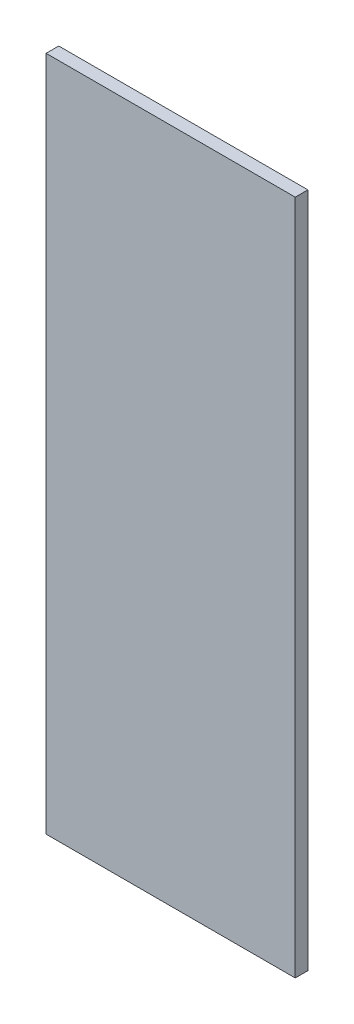
ISO-10303-21;
HEADER;
FILE_DESCRIPTION(('STEP AP214'),'2;1');
FILE_NAME('part.step','',(''),(''),'','','');
FILE_SCHEMA(('AUTOMOTIVE_DESIGN { 1 0 10303 214 1 1 1 1 }'));
ENDSEC;
DATA;
#1=APPLICATION_CONTEXT('core data for automotive mechanical design processes');
#2=APPLICATION_PROTOCOL_DEFINITION('international standard','automotive_design',2000,#1);
#3=PRODUCT_CONTEXT('',#1,'mechanical');
#4=PRODUCT('Part','Part','',(#3));
#5=PRODUCT_RELATED_PRODUCT_CATEGORY('part','',(#4));
#6=PRODUCT_DEFINITION_FORMATION('','',#4);
#7=PRODUCT_DEFINITION_CONTEXT('part definition',#1,'design');
#8=PRODUCT_DEFINITION('design','',#6,#7);
#9=PRODUCT_DEFINITION_SHAPE('','',#8);
#10=(LENGTH_UNIT() NAMED_UNIT(*) SI_UNIT(.MILLI.,.METRE.));
#11=(NAMED_UNIT(*) PLANE_ANGLE_UNIT() SI_UNIT($,.RADIAN.));
#12=(NAMED_UNIT(*) SI_UNIT($,.STERADIAN.) SOLID_ANGLE_UNIT());
#13=UNCERTAINTY_MEASURE_WITH_UNIT(LENGTH_MEASURE(1.E-05),#10,'distance_accuracy_value','');
#14=(GEOMETRIC_REPRESENTATION_CONTEXT(3) GLOBAL_UNCERTAINTY_ASSIGNED_CONTEXT((#13)) GLOBAL_UNIT_ASSIGNED_CONTEXT((#10,
#11,#12)) REPRESENTATION_CONTEXT('',''));
#15=CARTESIAN_POINT('',(0.,0.,0.));
#16=DIRECTION('',(0.,0.,1.));
#17=DIRECTION('',(1.,0.,0.));
#18=AXIS2_PLACEMENT_3D('',#15,#16,#17);
#19=CARTESIAN_POINT('',(91.6920013427734,53.8279991149902,0.));
#20=DIRECTION('',(1.,0.,0.));
#21=DIRECTION('',(0.,-1.,0.));
#22=AXIS2_PLACEMENT_3D('',#19,#20,#21);
#23=PLANE('',#22);
#24=DIRECTION('',(0.,-1.,0.));
#25=VECTOR('',#24,1.);
#26=CARTESIAN_POINT('',(91.6920013427734,53.8279991149902,0.03556));
#27=LINE('',#26,#25);
#28=CARTESIAN_POINT('',(91.6920013427734,53.8279991149902,0.03556));
#29=VERTEX_POINT('',#28);
#30=CARTESIAN_POINT('',(91.6920013427734,51.9280014038086,0.03556));
#31=VERTEX_POINT('',#30);
#32=EDGE_CURVE('E11',#29,#31,#27,.T.);
#33=ORIENTED_EDGE('',*,*,#32,.F.);
#34=DIRECTION('',(0.,0.,1.));
#35=VECTOR('',#34,1.);
#36=CARTESIAN_POINT('',(91.6920013427734,53.8279991149902,0.));
#37=LINE('',#36,#35);
#38=CARTESIAN_POINT('',(91.6920013427734,53.8279991149902,0.));
#39=VERTEX_POINT('',#38);
#40=EDGE_CURVE('E24',#39,#29,#37,.T.);
#41=ORIENTED_EDGE('',*,*,#40,.F.);
#42=DIRECTION('',(0.,-1.,0.));
#43=VECTOR('',#42,1.);
#44=CARTESIAN_POINT('',(91.6920013427734,53.8279991149902,0.));
#45=LINE('',#44,#43);
#46=CARTESIAN_POINT('',(91.6920013427734,51.9280014038086,0.));
#47=VERTEX_POINT('',#46);
#48=EDGE_CURVE('E75',#39,#47,#45,.T.);
#49=ORIENTED_EDGE('',*,*,#48,.T.);
#50=DIRECTION('',(0.,0.,1.));
#51=VECTOR('',#50,1.);
#52=CARTESIAN_POINT('',(91.6920013427734,51.9280014038086,0.));
#53=LINE('',#52,#51);
#54=EDGE_CURVE('E37',#47,#31,#53,.T.);
#55=ORIENTED_EDGE('',*,*,#54,.T.);
#56=EDGE_LOOP('',(#33,#41,#49,#55));
#57=FACE_BOUND('',#56,.T.);
#58=ADVANCED_FACE('F17',(#57),#23,.F.);
#59=CARTESIAN_POINT('',(91.6920013427734,51.9280014038086,0.));
#60=DIRECTION('',(0.,1.,0.));
#61=DIRECTION('',(1.,0.,0.));
#62=AXIS2_PLACEMENT_3D('',#59,#60,#61);
#63=PLANE('',#62);
#64=DIRECTION('',(1.,0.,0.));
#65=VECTOR('',#64,1.);
#66=CARTESIAN_POINT('',(91.6920013427734,51.9280014038086,0.03556));
#67=LINE('',#66,#65);
#68=CARTESIAN_POINT('',(92.3919982910156,51.9280014038086,0.03556));
#69=VERTEX_POINT('',#68);
#70=EDGE_CURVE('E83',#31,#69,#67,.T.);
#71=ORIENTED_EDGE('',*,*,#70,.F.);
#72=ORIENTED_EDGE('',*,*,#54,.F.);
#73=DIRECTION('',(1.,0.,0.));
#74=VECTOR('',#73,1.);
#75=CARTESIAN_POINT('',(91.6920013427734,51.9280014038086,0.));
#76=LINE('',#75,#74);
#77=CARTESIAN_POINT('',(92.3919982910156,51.9280014038086,0.));
#78=VERTEX_POINT('',#77);
#79=EDGE_CURVE('E81',#47,#78,#76,.T.);
#80=ORIENTED_EDGE('',*,*,#79,.T.);
#81=DIRECTION('',(0.,0.,1.));
#82=VECTOR('',#81,1.);
#83=CARTESIAN_POINT('',(92.3919982910156,51.9280014038086,0.));
#84=LINE('',#83,#82);
#85=EDGE_CURVE('E67',#78,#69,#84,.T.);
#86=ORIENTED_EDGE('',*,*,#85,.T.);
#87=EDGE_LOOP('',(#71,#72,#80,#86));
#88=FACE_BOUND('',#87,.T.);
#89=ADVANCED_FACE('F89',(#88),#63,.F.);
#90=CARTESIAN_POINT('',(92.3919982910156,51.9280014038086,0.));
#91=DIRECTION('',(-1.,0.,0.));
#92=DIRECTION('',(0.,1.,0.));
#93=AXIS2_PLACEMENT_3D('',#90,#91,#92);
#94=PLANE('',#93);
#95=DIRECTION('',(0.,1.,0.));
#96=VECTOR('',#95,1.);
#97=CARTESIAN_POINT('',(92.3919982910156,51.9280014038086,0.03556));
#98=LINE('',#97,#96);
#99=CARTESIAN_POINT('',(92.3919982910156,53.8279991149902,0.03556));
#100=VERTEX_POINT('',#99);
#101=EDGE_CURVE('E71',#69,#100,#98,.T.);
#102=ORIENTED_EDGE('',*,*,#101,.F.);
#103=ORIENTED_EDGE('',*,*,#85,.F.);
#104=DIRECTION('',(0.,1.,0.));
#105=VECTOR('',#104,1.);
#106=CARTESIAN_POINT('',(92.3919982910156,51.9280014038086,0.));
#107=LINE('',#106,#105);
#108=CARTESIAN_POINT('',(92.3919982910156,53.8279991149902,0.));
#109=VERTEX_POINT('',#108);
#110=EDGE_CURVE('E63',#78,#109,#107,.T.);
#111=ORIENTED_EDGE('',*,*,#110,.T.);
#112=DIRECTION('',(0.,0.,1.));
#113=VECTOR('',#112,1.);
#114=CARTESIAN_POINT('',(92.3919982910156,53.8279991149902,0.));
#115=LINE('',#114,#113);
#116=EDGE_CURVE('E53',#109,#100,#115,.T.);
#117=ORIENTED_EDGE('',*,*,#116,.T.);
#118=EDGE_LOOP('',(#102,#103,#111,#117));
#119=FACE_BOUND('',#118,.T.);
#120=ADVANCED_FACE('F66',(#119),#94,.F.);
#121=CARTESIAN_POINT('',(92.3919982910156,53.8279991149902,0.));
#122=DIRECTION('',(0.,-1.,0.));
#123=DIRECTION('',(-1.,0.,0.));
#124=AXIS2_PLACEMENT_3D('',#121,#122,#123);
#125=PLANE('',#124);
#126=DIRECTION('',(-1.,0.,0.));
#127=VECTOR('',#126,1.);
#128=CARTESIAN_POINT('',(92.3919982910156,53.8279991149902,0.03556));
#129=LINE('',#128,#127);
#130=EDGE_CURVE('E59',#100,#29,#129,.T.);
#131=ORIENTED_EDGE('',*,*,#130,.F.);
#132=ORIENTED_EDGE('',*,*,#116,.F.);
#133=DIRECTION('',(-1.,0.,0.));
#134=VECTOR('',#133,1.);
#135=CARTESIAN_POINT('',(92.3919982910156,53.8279991149902,0.));
#136=LINE('',#135,#134);
#137=EDGE_CURVE('E57',#109,#39,#136,.T.);
#138=ORIENTED_EDGE('',*,*,#137,.T.);
#139=ORIENTED_EDGE('',*,*,#40,.T.);
#140=EDGE_LOOP('',(#131,#132,#138,#139));
#141=FACE_BOUND('',#140,.T.);
#142=ADVANCED_FACE('F55',(#141),#125,.F.);
#143=CARTESIAN_POINT('',(91.6920013427734,53.8279991149902,0.));
#144=DIRECTION('',(0.,0.,-1.));
#145=DIRECTION('',(-1.,0.,0.));
#146=AXIS2_PLACEMENT_3D('',#143,#144,#145);
#147=PLANE('',#146);
#148=ORIENTED_EDGE('',*,*,#137,.F.);
#149=ORIENTED_EDGE('',*,*,#110,.F.);
#150=ORIENTED_EDGE('',*,*,#79,.F.);
#151=ORIENTED_EDGE('',*,*,#48,.F.);
#152=EDGE_LOOP('',(#148,#149,#150,#151));
#153=FACE_BOUND('',#152,.T.);
#154=ADVANCED_FACE('F74',(#153),#147,.T.);
#155=CARTESIAN_POINT('',(91.6920013427734,53.8279991149902,0.03556));
#156=DIRECTION('',(0.,0.,-1.));
#157=DIRECTION('',(-1.,0.,0.));
#158=AXIS2_PLACEMENT_3D('',#155,#156,#157);
#159=PLANE('',#158);
#160=ORIENTED_EDGE('',*,*,#32,.T.);
#161=ORIENTED_EDGE('',*,*,#70,.T.);
#162=ORIENTED_EDGE('',*,*,#101,.T.);
#163=ORIENTED_EDGE('',*,*,#130,.T.);
#164=EDGE_LOOP('',(#160,#161,#162,#163));
#165=FACE_BOUND('',#164,.T.);
#166=ADVANCED_FACE('F91',(#165),#159,.F.);
#167=CLOSED_SHELL('',(#58,#89,#120,#142,#154,#166));
#168=MANIFOLD_SOLID_BREP('B1',#167);
#169=ADVANCED_BREP_SHAPE_REPRESENTATION('',(#18,#168),#14);
#170=SHAPE_DEFINITION_REPRESENTATION(#9,#169);
ENDSEC;
END-ISO-10303-21;
